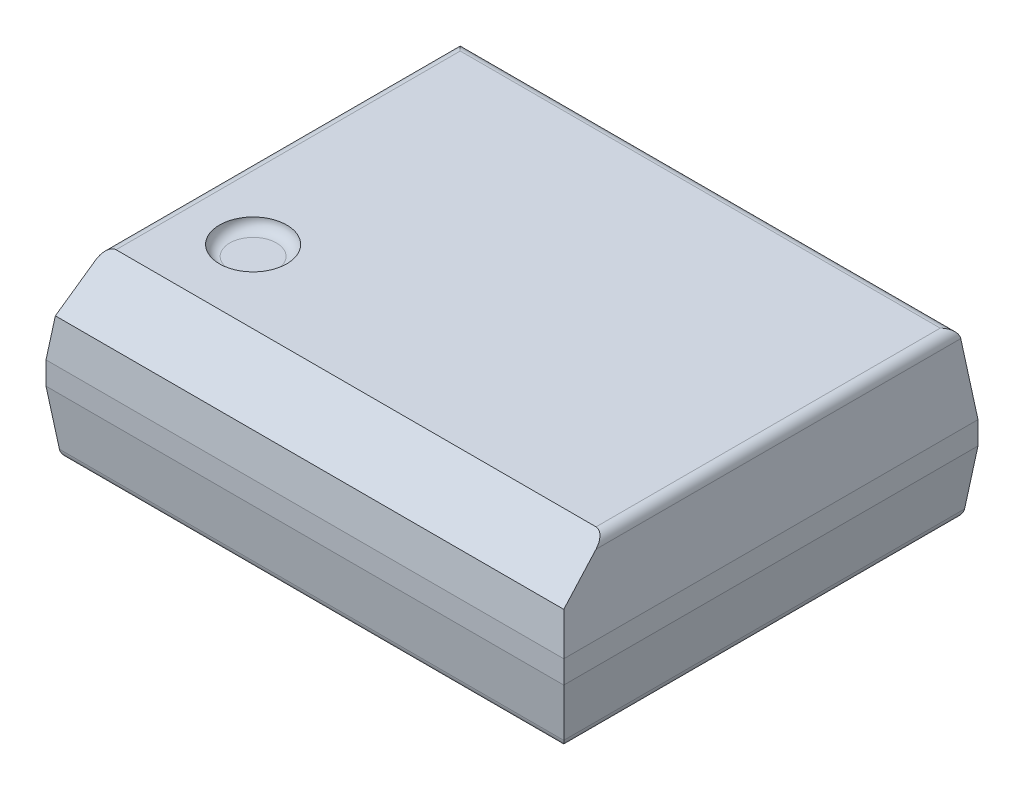
ISO-10303-21;
HEADER;
FILE_DESCRIPTION(('STEP AP214'),'2;1');
FILE_NAME('part.step','',(''),(''),'','','');
FILE_SCHEMA(('AUTOMOTIVE_DESIGN { 1 0 10303 214 1 1 1 1 }'));
ENDSEC;
DATA;
#1=APPLICATION_CONTEXT('core data for automotive mechanical design processes');
#2=APPLICATION_PROTOCOL_DEFINITION('international standard','automotive_design',2000,#1);
#3=PRODUCT_CONTEXT('',#1,'mechanical');
#4=PRODUCT('Part','Part','',(#3));
#5=PRODUCT_RELATED_PRODUCT_CATEGORY('part','',(#4));
#6=PRODUCT_DEFINITION_FORMATION('','',#4);
#7=PRODUCT_DEFINITION_CONTEXT('part definition',#1,'design');
#8=PRODUCT_DEFINITION('design','',#6,#7);
#9=PRODUCT_DEFINITION_SHAPE('','',#8);
#10=(LENGTH_UNIT() NAMED_UNIT(*) SI_UNIT(.MILLI.,.METRE.));
#11=(NAMED_UNIT(*) PLANE_ANGLE_UNIT() SI_UNIT($,.RADIAN.));
#12=(NAMED_UNIT(*) SI_UNIT($,.STERADIAN.) SOLID_ANGLE_UNIT());
#13=UNCERTAINTY_MEASURE_WITH_UNIT(LENGTH_MEASURE(1.E-05),#10,'distance_accuracy_value','');
#14=(GEOMETRIC_REPRESENTATION_CONTEXT(3) GLOBAL_UNCERTAINTY_ASSIGNED_CONTEXT((#13)) GLOBAL_UNIT_ASSIGNED_CONTEXT((#10,
#11,#12)) REPRESENTATION_CONTEXT('',''));
#15=CARTESIAN_POINT('',(0.,0.,0.));
#16=DIRECTION('',(0.,0.,1.));
#17=DIRECTION('',(1.,0.,0.));
#18=AXIS2_PLACEMENT_3D('',#15,#16,#17);
#19=CARTESIAN_POINT('',(-1.7,1.65,0.8));
#20=DIRECTION('',(0.,1.,0.));
#21=DIRECTION('',(0.,0.,1.));
#22=AXIS2_PLACEMENT_3D('',#19,#20,#21);
#23=PLANE('',#22);
#24=CARTESIAN_POINT('',(-1.7,1.65,0.8));
#25=DIRECTION('',(0.,1.,0.));
#26=DIRECTION('',(0.,0.,1.));
#27=AXIS2_PLACEMENT_3D('',#24,#25,#26);
#28=CIRCLE('',#27,0.225);
#29=CARTESIAN_POINT('',(-1.7,1.65,1.025));
#30=VERTEX_POINT('',#29);
#31=EDGE_CURVE('E21',#30,#30,#28,.T.);
#32=ORIENTED_EDGE('',*,*,#31,.T.);
#33=EDGE_LOOP('',(#32));
#34=FACE_BOUND('',#33,.T.);
#35=ADVANCED_FACE('F17',(#34),#23,.T.);
#36=CARTESIAN_POINT('',(-1.7,1.75,0.8));
#37=DIRECTION('',(0.,1.,0.));
#38=DIRECTION('',(0.,0.,1.));
#39=AXIS2_PLACEMENT_3D('',#36,#37,#38);
#40=TOROIDAL_SURFACE('',#39,0.225,0.1);
#41=ORIENTED_EDGE('',*,*,#31,.F.);
#42=EDGE_LOOP('',(#41));
#43=FACE_BOUND('',#42,.T.);
#44=CARTESIAN_POINT('',(-1.7,1.75,0.8));
#45=DIRECTION('',(0.,1.,0.));
#46=DIRECTION('',(0.,0.,1.));
#47=AXIS2_PLACEMENT_3D('',#44,#45,#46);
#48=CIRCLE('',#47,0.325);
#49=CARTESIAN_POINT('',(-1.7,1.75,1.125));
#50=VERTEX_POINT('',#49);
#51=EDGE_CURVE('E101',#50,#50,#48,.F.);
#52=ORIENTED_EDGE('',*,*,#51,.F.);
#53=EDGE_LOOP('',(#52));
#54=FACE_BOUND('',#53,.T.);
#55=ADVANCED_FACE('F19',(#43,#54),#40,.F.);
#56=CARTESIAN_POINT('',(0.,1.75,0.));
#57=DIRECTION('',(0.,1.,0.));
#58=DIRECTION('',(0.,0.,1.));
#59=AXIS2_PLACEMENT_3D('',#56,#57,#58);
#60=PLANE('',#59);
#61=ORIENTED_EDGE('',*,*,#51,.T.);
#62=EDGE_LOOP('',(#61));
#63=FACE_BOUND('',#62,.T.);
#64=DIRECTION('',(0.,0.,-1.));
#65=VECTOR('',#64,1.);
#66=CARTESIAN_POINT('',(-2.317597284454,1.75,0.));
#67=LINE('',#66,#65);
#68=CARTESIAN_POINT('',(-2.317597284454,1.75000000000004,1.50606981090926));
#69=VERTEX_POINT('',#68);
#70=CARTESIAN_POINT('',(-2.317597284454,1.75,-1.817597284454));
#71=VERTEX_POINT('',#70);
#72=EDGE_CURVE('E93',#69,#71,#67,.T.);
#73=ORIENTED_EDGE('',*,*,#72,.F.);
#74=DIRECTION('',(1.,0.,0.));
#75=VECTOR('',#74,1.);
#76=CARTESIAN_POINT('',(0.,1.75000000000018,1.50606981090916));
#77=LINE('',#76,#75);
#78=CARTESIAN_POINT('',(2.317597284454,1.75000000000004,1.50606981090926));
#79=VERTEX_POINT('',#78);
#80=EDGE_CURVE('E81',#79,#69,#77,.F.);
#81=ORIENTED_EDGE('',*,*,#80,.F.);
#82=DIRECTION('',(0.,0.,1.));
#83=VECTOR('',#82,1.);
#84=CARTESIAN_POINT('',(2.317597284454,1.75,0.));
#85=LINE('',#84,#83);
#86=CARTESIAN_POINT('',(2.317597284454,1.75,-1.817597284454));
#87=VERTEX_POINT('',#86);
#88=EDGE_CURVE('E108',#87,#79,#85,.T.);
#89=ORIENTED_EDGE('',*,*,#88,.F.);
#90=DIRECTION('',(1.,0.,0.));
#91=VECTOR('',#90,1.);
#92=CARTESIAN_POINT('',(0.,1.75,-1.817597284454));
#93=LINE('',#92,#91);
#94=EDGE_CURVE('E97',#71,#87,#93,.T.);
#95=ORIENTED_EDGE('',*,*,#94,.F.);
#96=EDGE_LOOP('',(#73,#81,#89,#95));
#97=FACE_BOUND('',#96,.T.);
#98=ADVANCED_FACE('F96',(#63,#97),#60,.T.);
#99=CARTESIAN_POINT('',(-2.317597284454,1.65,0.));
#100=DIRECTION('',(0.,0.,-1.));
#101=DIRECTION('',(0.,1.,0.));
#102=AXIS2_PLACEMENT_3D('',#99,#100,#101);
#103=CYLINDRICAL_SURFACE('',#102,0.1);
#104=CARTESIAN_POINT('',(-2.317597284454,1.65,1.61909924954549));
#105=DIRECTION('',(0.,0.748955720788871,0.662620048215886));
#106=DIRECTION('',(0.,0.662620048215886,-0.748955720788871));
#107=AXIS2_PLACEMENT_3D('',#104,#105,#106);
#108=ELLIPSE('',#107,0.150916049505673,0.1);
#109=CARTESIAN_POINT('',(-2.41685189961814,1.66218693434077,1.60532442607316));
#110=VERTEX_POINT('',#109);
#111=EDGE_CURVE('E87',#69,#110,#108,.T.);
#112=ORIENTED_EDGE('',*,*,#111,.F.);
#113=ORIENTED_EDGE('',*,*,#72,.T.);
#114=CARTESIAN_POINT('',(-2.317597284454,1.65,-1.817597284454));
#115=DIRECTION('',(0.707106781186547,0.,-0.707106781186547));
#116=DIRECTION('',(0.707106781186547,0.,0.707106781186547));
#117=AXIS2_PLACEMENT_3D('',#114,#115,#116);
#118=ELLIPSE('',#117,0.14142135623731,0.1);
#119=CARTESIAN_POINT('',(-2.41685189961807,1.66218693434076,-1.91685189961814));
#120=VERTEX_POINT('',#119);
#121=EDGE_CURVE('E361',#120,#71,#118,.T.);
#122=ORIENTED_EDGE('',*,*,#121,.F.);
#123=DIRECTION('',(0.,0.,1.));
#124=VECTOR('',#123,1.);
#125=CARTESIAN_POINT('',(-2.41685189961815,1.66218693434102,0.));
#126=LINE('',#125,#124);
#127=EDGE_CURVE('E105',#110,#120,#126,.F.);
#128=ORIENTED_EDGE('',*,*,#127,.F.);
#129=EDGE_LOOP('',(#112,#113,#122,#128));
#130=FACE_BOUND('',#129,.T.);
#131=ADVANCED_FACE('F104',(#130),#103,.T.);
#132=CARTESIAN_POINT('',(0.,1.551490769672,1.73044367959));
#133=DIRECTION('',(0.,0.748955720788871,0.662620048215886));
#134=DIRECTION('',(0.,-0.662620048215886,0.748955720788871));
#135=AXIS2_PLACEMENT_3D('',#132,#133,#134);
#136=PLANE('',#135);
#137=DIRECTION('',(1.,0.,0.));
#138=VECTOR('',#137,1.);
#139=CARTESIAN_POINT('',(0.,1.35298153934309,1.95481754827174));
#140=LINE('',#139,#138);
#141=CARTESIAN_POINT('',(2.4548175482715,1.35298153934319,1.95481754827136));
#142=VERTEX_POINT('',#141);
#143=CARTESIAN_POINT('',(-2.45481754827126,1.35298153934298,1.95481754827162));
#144=VERTEX_POINT('',#143);
#145=EDGE_CURVE('E373',#142,#144,#140,.F.);
#146=ORIENTED_EDGE('',*,*,#145,.F.);
#147=DIRECTION('',(-0.0810915667917727,0.660437812349629,-0.746489151839524));
#148=VECTOR('',#147,1.);
#149=CARTESIAN_POINT('',(2.454817548271,1.35298153934338,1.95481754827134));
#150=LINE('',#149,#148);
#151=CARTESIAN_POINT('',(2.41685189961815,1.66218693434067,1.60532442607327));
#152=VERTEX_POINT('',#151);
#153=EDGE_CURVE('E106',#142,#152,#150,.T.);
#154=ORIENTED_EDGE('',*,*,#153,.T.);
#155=CARTESIAN_POINT('',(2.317597284454,1.65,1.61909924954549));
#156=DIRECTION('',(0.,0.748955720788871,0.662620048215886));
#157=DIRECTION('',(0.,-0.662620048215886,0.748955720788871));
#158=AXIS2_PLACEMENT_3D('',#155,#156,#157);
#159=ELLIPSE('',#158,0.150916049505673,0.1);
#160=EDGE_CURVE('E90',#79,#152,#159,.F.);
#161=ORIENTED_EDGE('',*,*,#160,.F.);
#162=ORIENTED_EDGE('',*,*,#80,.T.);
#163=ORIENTED_EDGE('',*,*,#111,.T.);
#164=DIRECTION('',(0.0810915667930464,0.660437812350393,-0.74648915183871));
#165=VECTOR('',#164,1.);
#166=CARTESIAN_POINT('',(-2.45481754827174,1.35298153934309,1.954817548271));
#167=LINE('',#166,#165);
#168=EDGE_CURVE('E384',#144,#110,#167,.T.);
#169=ORIENTED_EDGE('',*,*,#168,.F.);
#170=EDGE_LOOP('',(#146,#154,#161,#162,#163,#169));
#171=FACE_BOUND('',#170,.T.);
#172=ADVANCED_FACE('F84',(#171),#136,.T.);
#173=CARTESIAN_POINT('',(2.317597284454,1.65,0.));
#174=DIRECTION('',(0.,0.,1.));
#175=DIRECTION('',(0.,-1.,0.));
#176=AXIS2_PLACEMENT_3D('',#173,#174,#175);
#177=CYLINDRICAL_SURFACE('',#176,0.1);
#178=ORIENTED_EDGE('',*,*,#160,.T.);
#179=DIRECTION('',(0.,0.,1.));
#180=VECTOR('',#179,1.);
#181=CARTESIAN_POINT('',(2.41685189961815,1.66218693434102,0.));
#182=LINE('',#181,#180);
#183=CARTESIAN_POINT('',(2.41685189961807,1.66218693434076,-1.91685189961814));
#184=VERTEX_POINT('',#183);
#185=EDGE_CURVE('E359',#184,#152,#182,.T.);
#186=ORIENTED_EDGE('',*,*,#185,.F.);
#187=CARTESIAN_POINT('',(2.317597284454,1.65,-1.817597284454));
#188=DIRECTION('',(0.707106781186547,0.,0.707106781186547));
#189=DIRECTION('',(0.707106781186547,0.,-0.707106781186547));
#190=AXIS2_PLACEMENT_3D('',#187,#188,#189);
#191=ELLIPSE('',#190,0.14142135623731,0.1);
#192=EDGE_CURVE('E382',#87,#184,#191,.F.);
#193=ORIENTED_EDGE('',*,*,#192,.F.);
#194=ORIENTED_EDGE('',*,*,#88,.T.);
#195=EDGE_LOOP('',(#178,#186,#193,#194));
#196=FACE_BOUND('',#195,.T.);
#197=ADVANCED_FACE('F201',(#196),#177,.T.);
#198=CARTESIAN_POINT('',(0.,1.65,-1.817597284454));
#199=DIRECTION('',(1.,0.,0.));
#200=DIRECTION('',(0.,1.,0.));
#201=AXIS2_PLACEMENT_3D('',#198,#199,#200);
#202=CYLINDRICAL_SURFACE('',#201,0.1);
#203=ORIENTED_EDGE('',*,*,#94,.T.);
#204=ORIENTED_EDGE('',*,*,#192,.T.);
#205=DIRECTION('',(1.,0.,0.));
#206=VECTOR('',#205,1.);
#207=CARTESIAN_POINT('',(0.,1.66218693434102,-1.91685189961815));
#208=LINE('',#207,#206);
#209=EDGE_CURVE('E378',#120,#184,#208,.T.);
#210=ORIENTED_EDGE('',*,*,#209,.F.);
#211=ORIENTED_EDGE('',*,*,#121,.T.);
#212=EDGE_LOOP('',(#203,#204,#210,#211));
#213=FACE_BOUND('',#212,.T.);
#214=ADVANCED_FACE('F197',(#213),#202,.T.);
#215=CARTESIAN_POINT('',(-2.453034905455,1.3675,0.));
#216=DIRECTION('',(-0.992546151641335,0.121869343405041,0.));
#217=DIRECTION('',(-0.121869343405041,-0.992546151641335,0.));
#218=AXIS2_PLACEMENT_3D('',#215,#216,#217);
#219=PLANE('',#218);
#220=DIRECTION('',(0.12097429115101,0.985256536015348,0.120974291151254));
#221=VECTOR('',#220,1.);
#222=CARTESIAN_POINT('',(-2.5,0.985000000000039,-2.00000000000031));
#223=LINE('',#222,#221);
#224=CARTESIAN_POINT('',(-2.5,0.98500000000001,-2.00000000000008));
#225=VERTEX_POINT('',#224);
#226=EDGE_CURVE('E370',#225,#120,#223,.T.);
#227=ORIENTED_EDGE('',*,*,#226,.F.);
#228=DIRECTION('',(0.,0.,1.));
#229=VECTOR('',#228,1.);
#230=CARTESIAN_POINT('',(-2.5,0.985,0.));
#231=LINE('',#230,#229);
#232=CARTESIAN_POINT('',(-2.5,0.98500000000001,2.00000000000008));
#233=VERTEX_POINT('',#232);
#234=EDGE_CURVE('E425',#233,#225,#231,.F.);
#235=ORIENTED_EDGE('',*,*,#234,.F.);
#236=DIRECTION('',(-0.120974291152381,-0.985256536015182,0.120974291151235));
#237=VECTOR('',#236,1.);
#238=CARTESIAN_POINT('',(-2.454817548271,1.35298153934309,1.95481754827174));
#239=LINE('',#238,#237);
#240=EDGE_CURVE('E368',#144,#233,#239,.T.);
#241=ORIENTED_EDGE('',*,*,#240,.F.);
#242=ORIENTED_EDGE('',*,*,#168,.T.);
#243=ORIENTED_EDGE('',*,*,#127,.T.);
#244=EDGE_LOOP('',(#227,#235,#241,#242,#243));
#245=FACE_BOUND('',#244,.T.);
#246=ADVANCED_FACE('F193',(#245),#219,.T.);
#247=CARTESIAN_POINT('',(0.,1.3675,1.953034905455));
#248=DIRECTION('',(0.,0.121869343405041,0.992546151641335));
#249=DIRECTION('',(0.,-0.992546151641335,0.121869343405041));
#250=AXIS2_PLACEMENT_3D('',#247,#248,#249);
#251=PLANE('',#250);
#252=ORIENTED_EDGE('',*,*,#145,.T.);
#253=ORIENTED_EDGE('',*,*,#240,.T.);
#254=DIRECTION('',(1.,0.,0.));
#255=VECTOR('',#254,1.);
#256=CARTESIAN_POINT('',(0.,0.985,2.));
#257=LINE('',#256,#255);
#258=CARTESIAN_POINT('',(2.50000000000008,0.98500000000001,2.));
#259=VERTEX_POINT('',#258);
#260=EDGE_CURVE('E428',#259,#233,#257,.F.);
#261=ORIENTED_EDGE('',*,*,#260,.F.);
#262=DIRECTION('',(0.120974291151234,-0.985256536015182,0.120974291152381));
#263=VECTOR('',#262,1.);
#264=CARTESIAN_POINT('',(2.45481754827174,1.35298153934309,1.954817548271));
#265=LINE('',#264,#263);
#266=EDGE_CURVE('E367',#142,#259,#265,.T.);
#267=ORIENTED_EDGE('',*,*,#266,.F.);
#268=EDGE_LOOP('',(#252,#253,#261,#267));
#269=FACE_BOUND('',#268,.T.);
#270=ADVANCED_FACE('F189',(#269),#251,.T.);
#271=CARTESIAN_POINT('',(2.453034905455,1.3675,0.));
#272=DIRECTION('',(0.992546151641335,0.121869343405041,0.));
#273=DIRECTION('',(-0.121869343405041,0.992546151641335,0.));
#274=AXIS2_PLACEMENT_3D('',#271,#272,#273);
#275=PLANE('',#274);
#276=ORIENTED_EDGE('',*,*,#153,.F.);
#277=ORIENTED_EDGE('',*,*,#266,.T.);
#278=DIRECTION('',(0.,0.,-1.));
#279=VECTOR('',#278,1.);
#280=CARTESIAN_POINT('',(2.5,0.985,0.));
#281=LINE('',#280,#279);
#282=CARTESIAN_POINT('',(2.5,0.98500000000001,-2.00000000000008));
#283=VERTEX_POINT('',#282);
#284=EDGE_CURVE('E438',#283,#259,#281,.F.);
#285=ORIENTED_EDGE('',*,*,#284,.F.);
#286=DIRECTION('',(0.12097429115101,-0.985256536015348,-0.120974291151254));
#287=VECTOR('',#286,1.);
#288=CARTESIAN_POINT('',(2.416851899618,1.66218693434102,-1.91685189961815));
#289=LINE('',#288,#287);
#290=EDGE_CURVE('E366',#184,#283,#289,.T.);
#291=ORIENTED_EDGE('',*,*,#290,.F.);
#292=ORIENTED_EDGE('',*,*,#185,.T.);
#293=EDGE_LOOP('',(#276,#277,#285,#291,#292));
#294=FACE_BOUND('',#293,.T.);
#295=ADVANCED_FACE('F185',(#294),#275,.T.);
#296=CARTESIAN_POINT('',(0.,1.3675,-1.953034905455));
#297=DIRECTION('',(0.,0.121869343405041,-0.992546151641335));
#298=DIRECTION('',(0.,0.992546151641335,0.121869343405041));
#299=AXIS2_PLACEMENT_3D('',#296,#297,#298);
#300=PLANE('',#299);
#301=ORIENTED_EDGE('',*,*,#209,.T.);
#302=ORIENTED_EDGE('',*,*,#290,.T.);
#303=DIRECTION('',(-1.,0.,0.));
#304=VECTOR('',#303,1.);
#305=CARTESIAN_POINT('',(0.,0.985,-2.));
#306=LINE('',#305,#304);
#307=EDGE_CURVE('E414',#225,#283,#306,.F.);
#308=ORIENTED_EDGE('',*,*,#307,.F.);
#309=ORIENTED_EDGE('',*,*,#226,.T.);
#310=EDGE_LOOP('',(#301,#302,#308,#309));
#311=FACE_BOUND('',#310,.T.);
#312=ADVANCED_FACE('F181',(#311),#300,.T.);
#313=CARTESIAN_POINT('',(-2.5,0.15,0.));
#314=DIRECTION('',(-1.,0.,0.));
#315=DIRECTION('',(0.,0.,1.));
#316=AXIS2_PLACEMENT_3D('',#313,#314,#315);
#317=PLANE('',#316);
#318=DIRECTION('',(0.,0.,1.));
#319=VECTOR('',#318,1.);
#320=CARTESIAN_POINT('',(-2.49999999999962,0.765000000000047,0.));
#321=LINE('',#320,#319);
#322=CARTESIAN_POINT('',(-2.4999999999999,0.765000000000036,1.99999999999981));
#323=VERTEX_POINT('',#322);
#324=CARTESIAN_POINT('',(-2.4999999999999,0.765000000000036,-1.99999999999971));
#325=VERTEX_POINT('',#324);
#326=EDGE_CURVE('E470',#323,#325,#321,.F.);
#327=ORIENTED_EDGE('',*,*,#326,.F.);
#328=DIRECTION('',(0.,1.,0.));
#329=VECTOR('',#328,1.);
#330=CARTESIAN_POINT('',(-2.5,0.15,2.));
#331=LINE('',#330,#329);
#332=EDGE_CURVE('E431',#233,#323,#331,.F.);
#333=ORIENTED_EDGE('',*,*,#332,.F.);
#334=ORIENTED_EDGE('',*,*,#234,.T.);
#335=DIRECTION('',(0.,1.,0.));
#336=VECTOR('',#335,1.);
#337=CARTESIAN_POINT('',(-2.5,0.15,-2.));
#338=LINE('',#337,#336);
#339=EDGE_CURVE('E475',#325,#225,#338,.T.);
#340=ORIENTED_EDGE('',*,*,#339,.F.);
#341=EDGE_LOOP('',(#327,#333,#334,#340));
#342=FACE_BOUND('',#341,.T.);
#343=ADVANCED_FACE('F177',(#342),#317,.T.);
#344=CARTESIAN_POINT('',(0.,0.15,2.));
#345=DIRECTION('',(0.,0.,1.));
#346=DIRECTION('',(1.,0.,0.));
#347=AXIS2_PLACEMENT_3D('',#344,#345,#346);
#348=PLANE('',#347);
#349=DIRECTION('',(1.,0.,0.));
#350=VECTOR('',#349,1.);
#351=CARTESIAN_POINT('',(0.,0.765000000000047,1.99999999999962));
#352=LINE('',#351,#350);
#353=CARTESIAN_POINT('',(2.49999999999971,0.765000000000036,1.9999999999999));
#354=VERTEX_POINT('',#353);
#355=EDGE_CURVE('E466',#354,#323,#352,.F.);
#356=ORIENTED_EDGE('',*,*,#355,.F.);
#357=DIRECTION('',(0.,1.,0.));
#358=VECTOR('',#357,1.);
#359=CARTESIAN_POINT('',(2.5,0.15,2.));
#360=LINE('',#359,#358);
#361=EDGE_CURVE('E451',#259,#354,#360,.F.);
#362=ORIENTED_EDGE('',*,*,#361,.F.);
#363=ORIENTED_EDGE('',*,*,#260,.T.);
#364=ORIENTED_EDGE('',*,*,#332,.T.);
#365=EDGE_LOOP('',(#356,#362,#363,#364));
#366=FACE_BOUND('',#365,.T.);
#367=ADVANCED_FACE('F173',(#366),#348,.T.);
#368=CARTESIAN_POINT('',(2.5,0.15,0.));
#369=DIRECTION('',(1.,0.,0.));
#370=DIRECTION('',(0.,0.,-1.));
#371=AXIS2_PLACEMENT_3D('',#368,#369,#370);
#372=PLANE('',#371);
#373=DIRECTION('',(0.,0.,1.));
#374=VECTOR('',#373,1.);
#375=CARTESIAN_POINT('',(2.49999999999962,0.765000000000047,0.));
#376=LINE('',#375,#374);
#377=CARTESIAN_POINT('',(2.4999999999999,0.765000000000036,-1.99999999999971));
#378=VERTEX_POINT('',#377);
#379=EDGE_CURVE('E481',#378,#354,#376,.T.);
#380=ORIENTED_EDGE('',*,*,#379,.F.);
#381=DIRECTION('',(0.,1.,0.));
#382=VECTOR('',#381,1.);
#383=CARTESIAN_POINT('',(2.5,0.15,-2.));
#384=LINE('',#383,#382);
#385=EDGE_CURVE('E450',#283,#378,#384,.F.);
#386=ORIENTED_EDGE('',*,*,#385,.F.);
#387=ORIENTED_EDGE('',*,*,#284,.T.);
#388=ORIENTED_EDGE('',*,*,#361,.T.);
#389=EDGE_LOOP('',(#380,#386,#387,#388));
#390=FACE_BOUND('',#389,.T.);
#391=ADVANCED_FACE('F169',(#390),#372,.T.);
#392=CARTESIAN_POINT('',(0.,0.15,-2.));
#393=DIRECTION('',(0.,0.,-1.));
#394=DIRECTION('',(-1.,0.,0.));
#395=AXIS2_PLACEMENT_3D('',#392,#393,#394);
#396=PLANE('',#395);
#397=DIRECTION('',(1.,0.,0.));
#398=VECTOR('',#397,1.);
#399=CARTESIAN_POINT('',(0.,0.765000000000047,-1.99999999999962));
#400=LINE('',#399,#398);
#401=EDGE_CURVE('E486',#325,#378,#400,.T.);
#402=ORIENTED_EDGE('',*,*,#401,.F.);
#403=ORIENTED_EDGE('',*,*,#339,.T.);
#404=ORIENTED_EDGE('',*,*,#307,.T.);
#405=ORIENTED_EDGE('',*,*,#385,.T.);
#406=EDGE_LOOP('',(#402,#403,#404,#405));
#407=FACE_BOUND('',#406,.T.);
#408=ADVANCED_FACE('F165',(#407),#396,.T.);
#409=CARTESIAN_POINT('',(-2.462243747522,0.4575,0.));
#410=DIRECTION('',(-0.992546151641335,-0.121869343405041,0.));
#411=DIRECTION('',(0.121869343405041,-0.992546151641335,0.));
#412=AXIS2_PLACEMENT_3D('',#409,#410,#411);
#413=PLANE('',#412);
#414=DIRECTION('',(0.,0.,1.));
#415=VECTOR('',#414,1.);
#416=CARTESIAN_POINT('',(-2.43526958375307,0.237813065658991,0.));
#417=LINE('',#416,#415);
#418=CARTESIAN_POINT('',(-2.43526958375308,0.237813065659234,1.93526958375299));
#419=VERTEX_POINT('',#418);
#420=CARTESIAN_POINT('',(-2.43526958375308,0.237813065659234,-1.93526958375299));
#421=VERTEX_POINT('',#420);
#422=EDGE_CURVE('E509',#419,#421,#417,.F.);
#423=ORIENTED_EDGE('',*,*,#422,.F.);
#424=DIRECTION('',(0.120974291151702,-0.985256536015264,-0.120974291151244));
#425=VECTOR('',#424,1.);
#426=CARTESIAN_POINT('',(-2.5,0.765000000000047,1.99999999999962));
#427=LINE('',#426,#425);
#428=EDGE_CURVE('E469',#323,#419,#427,.T.);
#429=ORIENTED_EDGE('',*,*,#428,.F.);
#430=ORIENTED_EDGE('',*,*,#326,.T.);
#431=DIRECTION('',(-0.120974291151702,0.985256536015264,-0.120974291151244));
#432=VECTOR('',#431,1.);
#433=CARTESIAN_POINT('',(-2.435269583753,0.237813065659017,-1.93526958375286));
#434=LINE('',#433,#432);
#435=EDGE_CURVE('E504',#421,#325,#434,.T.);
#436=ORIENTED_EDGE('',*,*,#435,.F.);
#437=EDGE_LOOP('',(#423,#429,#430,#436));
#438=FACE_BOUND('',#437,.T.);
#439=ADVANCED_FACE('F161',(#438),#413,.T.);
#440=CARTESIAN_POINT('',(0.,0.4575,1.962243747522));
#441=DIRECTION('',(0.,-0.121869343405041,0.992546151641335));
#442=DIRECTION('',(0.,-0.992546151641335,-0.121869343405041));
#443=AXIS2_PLACEMENT_3D('',#440,#441,#442);
#444=PLANE('',#443);
#445=DIRECTION('',(1.,0.,0.));
#446=VECTOR('',#445,1.);
#447=CARTESIAN_POINT('',(0.,0.237813065658991,1.93526958375307));
#448=LINE('',#447,#446);
#449=CARTESIAN_POINT('',(2.435269583753,0.237813065659234,1.93526958375308));
#450=VERTEX_POINT('',#449);
#451=EDGE_CURVE('E406',#450,#419,#448,.F.);
#452=ORIENTED_EDGE('',*,*,#451,.F.);
#453=DIRECTION('',(-0.120974291151244,-0.985256536015264,-0.120974291151703));
#454=VECTOR('',#453,1.);
#455=CARTESIAN_POINT('',(2.49999999999962,0.765000000000047,2.));
#456=LINE('',#455,#454);
#457=EDGE_CURVE('E483',#354,#450,#456,.T.);
#458=ORIENTED_EDGE('',*,*,#457,.F.);
#459=ORIENTED_EDGE('',*,*,#355,.T.);
#460=ORIENTED_EDGE('',*,*,#428,.T.);
#461=EDGE_LOOP('',(#452,#458,#459,#460));
#462=FACE_BOUND('',#461,.T.);
#463=ADVANCED_FACE('F157',(#462),#444,.T.);
#464=CARTESIAN_POINT('',(2.462243747522,0.4575,0.));
#465=DIRECTION('',(0.992546151641335,-0.121869343405041,0.));
#466=DIRECTION('',(0.121869343405041,0.992546151641335,0.));
#467=AXIS2_PLACEMENT_3D('',#464,#465,#466);
#468=PLANE('',#467);
#469=DIRECTION('',(0.,0.,-1.));
#470=VECTOR('',#469,1.);
#471=CARTESIAN_POINT('',(2.43526958375307,0.237813065658991,0.));
#472=LINE('',#471,#470);
#473=CARTESIAN_POINT('',(2.43526958375308,0.237813065659234,-1.93526958375299));
#474=VERTEX_POINT('',#473);
#475=EDGE_CURVE('E403',#474,#450,#472,.F.);
#476=ORIENTED_EDGE('',*,*,#475,.F.);
#477=DIRECTION('',(-0.120974291151702,-0.985256536015264,0.120974291151244));
#478=VECTOR('',#477,1.);
#479=CARTESIAN_POINT('',(2.5,0.765000000000047,-1.99999999999962));
#480=LINE('',#479,#478);
#481=EDGE_CURVE('E489',#378,#474,#480,.T.);
#482=ORIENTED_EDGE('',*,*,#481,.F.);
#483=ORIENTED_EDGE('',*,*,#379,.T.);
#484=ORIENTED_EDGE('',*,*,#457,.T.);
#485=EDGE_LOOP('',(#476,#482,#483,#484));
#486=FACE_BOUND('',#485,.T.);
#487=ADVANCED_FACE('F153',(#486),#468,.T.);
#488=CARTESIAN_POINT('',(0.,0.4575,-1.962243747522));
#489=DIRECTION('',(0.,-0.121869343405041,-0.992546151641335));
#490=DIRECTION('',(0.,0.992546151641335,-0.121869343405041));
#491=AXIS2_PLACEMENT_3D('',#488,#489,#490);
#492=PLANE('',#491);
#493=DIRECTION('',(-1.,0.,0.));
#494=VECTOR('',#493,1.);
#495=CARTESIAN_POINT('',(0.,0.237813065658991,-1.93526958375307));
#496=LINE('',#495,#494);
#497=EDGE_CURVE('E400',#421,#474,#496,.F.);
#498=ORIENTED_EDGE('',*,*,#497,.F.);
#499=ORIENTED_EDGE('',*,*,#435,.T.);
#500=ORIENTED_EDGE('',*,*,#401,.T.);
#501=ORIENTED_EDGE('',*,*,#481,.T.);
#502=EDGE_LOOP('',(#498,#499,#500,#501));
#503=FACE_BOUND('',#502,.T.);
#504=ADVANCED_FACE('F149',(#503),#492,.T.);
#505=CARTESIAN_POINT('',(-2.336014968589,0.25,0.));
#506=DIRECTION('',(0.,0.,1.));
#507=DIRECTION('',(0.,-1.,0.));
#508=AXIS2_PLACEMENT_3D('',#505,#506,#507);
#509=CYLINDRICAL_SURFACE('',#508,0.1);
#510=DIRECTION('',(0.,0.,1.));
#511=VECTOR('',#510,1.);
#512=CARTESIAN_POINT('',(-2.336014968589,0.15,0.));
#513=LINE('',#512,#511);
#514=CARTESIAN_POINT('',(-2.336014968589,0.15,-1.836014968589));
#515=VERTEX_POINT('',#514);
#516=CARTESIAN_POINT('',(-2.336014968589,0.15,1.836014968589));
#517=VERTEX_POINT('',#516);
#518=EDGE_CURVE('E398',#515,#517,#513,.T.);
#519=ORIENTED_EDGE('',*,*,#518,.T.);
#520=CARTESIAN_POINT('',(-2.336014968589,0.25,1.836014968589));
#521=DIRECTION('',(0.707106781186547,0.,0.707106781186547));
#522=DIRECTION('',(0.707106781186547,0.,-0.707106781186547));
#523=AXIS2_PLACEMENT_3D('',#520,#521,#522);
#524=ELLIPSE('',#523,0.14142135623731,0.1);
#525=EDGE_CURVE('E404',#419,#517,#524,.T.);
#526=ORIENTED_EDGE('',*,*,#525,.F.);
#527=ORIENTED_EDGE('',*,*,#422,.T.);
#528=CARTESIAN_POINT('',(-2.336014968589,0.25,-1.836014968589));
#529=DIRECTION('',(-0.707106781186547,0.,0.707106781186547));
#530=DIRECTION('',(-0.707106781186547,0.,-0.707106781186547));
#531=AXIS2_PLACEMENT_3D('',#528,#529,#530);
#532=ELLIPSE('',#531,0.14142135623731,0.1);
#533=EDGE_CURVE('E395',#515,#421,#532,.F.);
#534=ORIENTED_EDGE('',*,*,#533,.F.);
#535=EDGE_LOOP('',(#519,#526,#527,#534));
#536=FACE_BOUND('',#535,.T.);
#537=ADVANCED_FACE('F145',(#536),#509,.T.);
#538=CARTESIAN_POINT('',(0.,0.25,1.836014968589));
#539=DIRECTION('',(1.,0.,0.));
#540=DIRECTION('',(0.,1.,0.));
#541=AXIS2_PLACEMENT_3D('',#538,#539,#540);
#542=CYLINDRICAL_SURFACE('',#541,0.1);
#543=DIRECTION('',(1.,0.,0.));
#544=VECTOR('',#543,1.);
#545=CARTESIAN_POINT('',(0.,0.15,1.836014968589));
#546=LINE('',#545,#544);
#547=CARTESIAN_POINT('',(2.336014968589,0.15,1.836014968589));
#548=VERTEX_POINT('',#547);
#549=EDGE_CURVE('E514',#517,#548,#546,.T.);
#550=ORIENTED_EDGE('',*,*,#549,.T.);
#551=CARTESIAN_POINT('',(2.336014968589,0.25,1.836014968589));
#552=DIRECTION('',(0.707106781186547,0.,-0.707106781186547));
#553=DIRECTION('',(-0.707106781186547,0.,-0.707106781186547));
#554=AXIS2_PLACEMENT_3D('',#551,#552,#553);
#555=ELLIPSE('',#554,0.14142135623731,0.1);
#556=EDGE_CURVE('E401',#450,#548,#555,.T.);
#557=ORIENTED_EDGE('',*,*,#556,.F.);
#558=ORIENTED_EDGE('',*,*,#451,.T.);
#559=ORIENTED_EDGE('',*,*,#525,.T.);
#560=EDGE_LOOP('',(#550,#557,#558,#559));
#561=FACE_BOUND('',#560,.T.);
#562=ADVANCED_FACE('F141',(#561),#542,.T.);
#563=CARTESIAN_POINT('',(2.336014968589,0.25,0.));
#564=DIRECTION('',(0.,0.,-1.));
#565=DIRECTION('',(0.,1.,0.));
#566=AXIS2_PLACEMENT_3D('',#563,#564,#565);
#567=CYLINDRICAL_SURFACE('',#566,0.1);
#568=DIRECTION('',(0.,0.,1.));
#569=VECTOR('',#568,1.);
#570=CARTESIAN_POINT('',(2.336014968589,0.15,0.));
#571=LINE('',#570,#569);
#572=CARTESIAN_POINT('',(2.336014968589,0.15,-1.836014968589));
#573=VERTEX_POINT('',#572);
#574=EDGE_CURVE('E27',#548,#573,#571,.F.);
#575=ORIENTED_EDGE('',*,*,#574,.T.);
#576=CARTESIAN_POINT('',(2.336014968589,0.25,-1.836014968589));
#577=DIRECTION('',(-0.707106781186547,0.,-0.707106781186547));
#578=DIRECTION('',(-0.707106781186547,0.,0.707106781186547));
#579=AXIS2_PLACEMENT_3D('',#576,#577,#578);
#580=ELLIPSE('',#579,0.14142135623731,0.1);
#581=EDGE_CURVE('E35',#474,#573,#580,.T.);
#582=ORIENTED_EDGE('',*,*,#581,.F.);
#583=ORIENTED_EDGE('',*,*,#475,.T.);
#584=ORIENTED_EDGE('',*,*,#556,.T.);
#585=EDGE_LOOP('',(#575,#582,#583,#584));
#586=FACE_BOUND('',#585,.T.);
#587=ADVANCED_FACE('F135',(#586),#567,.T.);
#588=CARTESIAN_POINT('',(0.,0.25,-1.836014968589));
#589=DIRECTION('',(-1.,0.,0.));
#590=DIRECTION('',(0.,-1.,0.));
#591=AXIS2_PLACEMENT_3D('',#588,#589,#590);
#592=CYLINDRICAL_SURFACE('',#591,0.1);
#593=DIRECTION('',(1.,0.,0.));
#594=VECTOR('',#593,1.);
#595=CARTESIAN_POINT('',(0.,0.15,-1.836014968589));
#596=LINE('',#595,#594);
#597=EDGE_CURVE('E11',#573,#515,#596,.F.);
#598=ORIENTED_EDGE('',*,*,#597,.T.);
#599=ORIENTED_EDGE('',*,*,#533,.T.);
#600=ORIENTED_EDGE('',*,*,#497,.T.);
#601=ORIENTED_EDGE('',*,*,#581,.T.);
#602=EDGE_LOOP('',(#598,#599,#600,#601));
#603=FACE_BOUND('',#602,.T.);
#604=ADVANCED_FACE('F129',(#603),#592,.T.);
#605=CARTESIAN_POINT('',(0.,0.15,0.));
#606=DIRECTION('',(0.,1.,0.));
#607=DIRECTION('',(0.,0.,1.));
#608=AXIS2_PLACEMENT_3D('',#605,#606,#607);
#609=PLANE('',#608);
#610=ORIENTED_EDGE('',*,*,#574,.F.);
#611=ORIENTED_EDGE('',*,*,#549,.F.);
#612=ORIENTED_EDGE('',*,*,#518,.F.);
#613=ORIENTED_EDGE('',*,*,#597,.F.);
#614=EDGE_LOOP('',(#610,#611,#612,#613));
#615=FACE_BOUND('',#614,.T.);
#616=ADVANCED_FACE('F127',(#615),#609,.F.);
#617=CLOSED_SHELL('',(#35,#55,#98,#131,#172,#197,#214,#246,#270,#295,#312,#343,#367,#391,#408,
#439,#463,#487,#504,#537,#562,#587,#604,#616));
#618=MANIFOLD_SOLID_BREP('B1',#617);
#619=ADVANCED_BREP_SHAPE_REPRESENTATION('',(#18,#618),#14);
#620=SHAPE_DEFINITION_REPRESENTATION(#9,#619);
ENDSEC;
END-ISO-10303-21;
